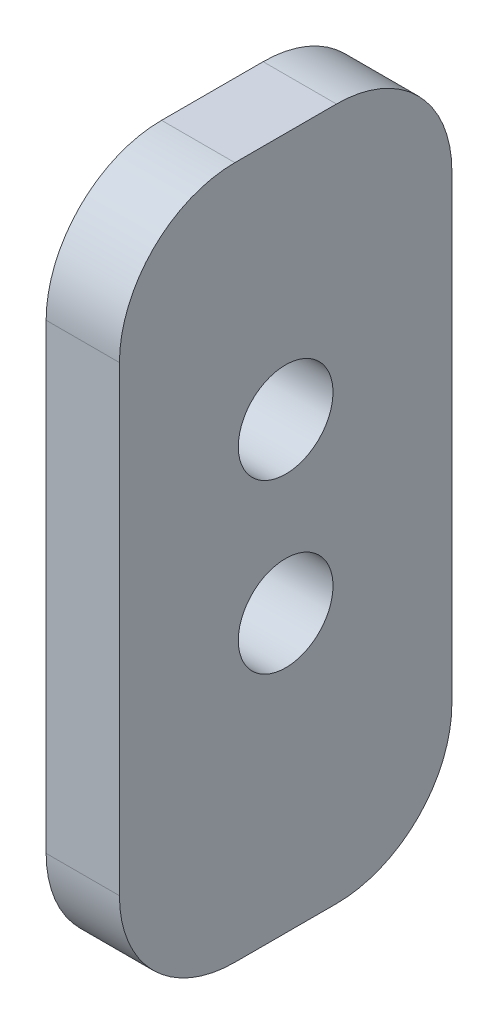
ISO-10303-21;
HEADER;
FILE_DESCRIPTION(('STEP AP214'),'2;1');
FILE_NAME('part.step','',(''),(''),'','','');
FILE_SCHEMA(('AUTOMOTIVE_DESIGN { 1 0 10303 214 1 1 1 1 }'));
ENDSEC;
DATA;
#1=APPLICATION_CONTEXT('core data for automotive mechanical design processes');
#2=APPLICATION_PROTOCOL_DEFINITION('international standard','automotive_design',2000,#1);
#3=PRODUCT_CONTEXT('',#1,'mechanical');
#4=PRODUCT('Part','Part','',(#3));
#5=PRODUCT_RELATED_PRODUCT_CATEGORY('part','',(#4));
#6=PRODUCT_DEFINITION_FORMATION('','',#4);
#7=PRODUCT_DEFINITION_CONTEXT('part definition',#1,'design');
#8=PRODUCT_DEFINITION('design','',#6,#7);
#9=PRODUCT_DEFINITION_SHAPE('','',#8);
#10=(LENGTH_UNIT() NAMED_UNIT(*) SI_UNIT(.MILLI.,.METRE.));
#11=(NAMED_UNIT(*) PLANE_ANGLE_UNIT() SI_UNIT($,.RADIAN.));
#12=(NAMED_UNIT(*) SI_UNIT($,.STERADIAN.) SOLID_ANGLE_UNIT());
#13=UNCERTAINTY_MEASURE_WITH_UNIT(LENGTH_MEASURE(1.E-05),#10,'distance_accuracy_value','');
#14=(GEOMETRIC_REPRESENTATION_CONTEXT(3) GLOBAL_UNCERTAINTY_ASSIGNED_CONTEXT((#13)) GLOBAL_UNIT_ASSIGNED_CONTEXT((#10,
#11,#12)) REPRESENTATION_CONTEXT('',''));
#15=CARTESIAN_POINT('',(0.,0.,0.));
#16=DIRECTION('',(0.,0.,1.));
#17=DIRECTION('',(1.,0.,0.));
#18=AXIS2_PLACEMENT_3D('',#15,#16,#17);
#19=CARTESIAN_POINT('',(6.35,0.,0.));
#20=DIRECTION('',(1.,0.,0.));
#21=DIRECTION('',(0.,0.,-1.));
#22=AXIS2_PLACEMENT_3D('',#19,#20,#21);
#23=PLANE('',#22);
#24=CARTESIAN_POINT('',(6.35,8.53000000000001,0.));
#25=DIRECTION('',(-1.,0.,0.));
#26=DIRECTION('',(0.,0.,1.));
#27=AXIS2_PLACEMENT_3D('',#24,#25,#26);
#28=CIRCLE('',#27,4.1021);
#29=CARTESIAN_POINT('',(6.35,8.53000000000001,4.1021));
#30=VERTEX_POINT('',#29);
#31=EDGE_CURVE('E178',#30,#30,#28,.T.);
#32=ORIENTED_EDGE('',*,*,#31,.T.);
#33=EDGE_LOOP('',(#32));
#34=FACE_BOUND('',#33,.T.);
#35=DIRECTION('',(0.,1.,0.));
#36=VECTOR('',#35,1.);
#37=CARTESIAN_POINT('',(6.35,0.,14.4));
#38=LINE('',#37,#36);
#39=CARTESIAN_POINT('',(6.35,-20.,14.4));
#40=VERTEX_POINT('',#39);
#41=CARTESIAN_POINT('',(6.35,20.,14.4));
#42=VERTEX_POINT('',#41);
#43=EDGE_CURVE('E162',#40,#42,#38,.T.);
#44=ORIENTED_EDGE('',*,*,#43,.F.);
#45=CARTESIAN_POINT('',(6.35,-20.,4.39999999999999));
#46=DIRECTION('',(1.,0.,0.));
#47=DIRECTION('',(0.,0.,-1.));
#48=AXIS2_PLACEMENT_3D('',#45,#46,#47);
#49=CIRCLE('',#48,10.);
#50=CARTESIAN_POINT('',(6.35,-30.,4.39999999999999));
#51=VERTEX_POINT('',#50);
#52=EDGE_CURVE('E151',#40,#51,#49,.T.);
#53=ORIENTED_EDGE('',*,*,#52,.T.);
#54=DIRECTION('',(0.,0.,1.));
#55=VECTOR('',#54,1.);
#56=CARTESIAN_POINT('',(6.35,-30.,0.));
#57=LINE('',#56,#55);
#58=CARTESIAN_POINT('',(6.35,-30.,-4.40000000000001));
#59=VERTEX_POINT('',#58);
#60=EDGE_CURVE('E164',#59,#51,#57,.T.);
#61=ORIENTED_EDGE('',*,*,#60,.F.);
#62=CARTESIAN_POINT('',(6.35,-20.,-4.40000000000001));
#63=DIRECTION('',(1.,0.,0.));
#64=DIRECTION('',(0.,0.,-1.));
#65=AXIS2_PLACEMENT_3D('',#62,#63,#64);
#66=CIRCLE('',#65,10.);
#67=CARTESIAN_POINT('',(6.35,-20.,-14.4));
#68=VERTEX_POINT('',#67);
#69=EDGE_CURVE('E128',#59,#68,#66,.T.);
#70=ORIENTED_EDGE('',*,*,#69,.T.);
#71=DIRECTION('',(0.,1.,0.));
#72=VECTOR('',#71,1.);
#73=CARTESIAN_POINT('',(6.35,0.,-14.4));
#74=LINE('',#73,#72);
#75=CARTESIAN_POINT('',(6.35,20.,-14.4));
#76=VERTEX_POINT('',#75);
#77=EDGE_CURVE('E133',#68,#76,#74,.T.);
#78=ORIENTED_EDGE('',*,*,#77,.T.);
#79=CARTESIAN_POINT('',(6.35,20.,-4.4));
#80=DIRECTION('',(1.,0.,0.));
#81=DIRECTION('',(0.,0.,-1.));
#82=AXIS2_PLACEMENT_3D('',#79,#80,#81);
#83=CIRCLE('',#82,10.);
#84=CARTESIAN_POINT('',(6.35,30.,-4.4));
#85=VERTEX_POINT('',#84);
#86=EDGE_CURVE('E57',#76,#85,#83,.T.);
#87=ORIENTED_EDGE('',*,*,#86,.T.);
#88=DIRECTION('',(0.,0.,1.));
#89=VECTOR('',#88,1.);
#90=CARTESIAN_POINT('',(6.35,30.,0.));
#91=LINE('',#90,#89);
#92=CARTESIAN_POINT('',(6.35,30.,4.4));
#93=VERTEX_POINT('',#92);
#94=EDGE_CURVE('E129',#85,#93,#91,.T.);
#95=ORIENTED_EDGE('',*,*,#94,.T.);
#96=CARTESIAN_POINT('',(6.35,20.,4.4));
#97=DIRECTION('',(1.,0.,0.));
#98=DIRECTION('',(0.,0.,-1.));
#99=AXIS2_PLACEMENT_3D('',#96,#97,#98);
#100=CIRCLE('',#99,10.);
#101=EDGE_CURVE('E148',#93,#42,#100,.T.);
#102=ORIENTED_EDGE('',*,*,#101,.T.);
#103=EDGE_LOOP('',(#44,#53,#61,#70,#78,#87,#95,#102));
#104=FACE_BOUND('',#103,.T.);
#105=CARTESIAN_POINT('',(6.35,-5.99999999999999,0.));
#106=DIRECTION('',(-1.,0.,0.));
#107=DIRECTION('',(0.,0.,1.));
#108=AXIS2_PLACEMENT_3D('',#105,#106,#107);
#109=CIRCLE('',#108,4.1021);
#110=CARTESIAN_POINT('',(6.35,-5.99999999999999,4.1021));
#111=VERTEX_POINT('',#110);
#112=EDGE_CURVE('E169',#111,#111,#109,.T.);
#113=ORIENTED_EDGE('',*,*,#112,.T.);
#114=EDGE_LOOP('',(#113));
#115=FACE_BOUND('',#114,.T.);
#116=ADVANCED_FACE('F37',(#34,#104,#115),#23,.T.);
#117=CARTESIAN_POINT('',(0.,0.,0.));
#118=DIRECTION('',(1.,0.,0.));
#119=DIRECTION('',(0.,0.,-1.));
#120=AXIS2_PLACEMENT_3D('',#117,#118,#119);
#121=PLANE('',#120);
#122=CARTESIAN_POINT('',(0.,8.53000000000001,0.));
#123=DIRECTION('',(-1.,0.,0.));
#124=DIRECTION('',(0.,0.,1.));
#125=AXIS2_PLACEMENT_3D('',#122,#123,#124);
#126=CIRCLE('',#125,4.1021);
#127=CARTESIAN_POINT('',(0.,8.53000000000001,4.1021));
#128=VERTEX_POINT('',#127);
#129=EDGE_CURVE('E181',#128,#128,#126,.T.);
#130=ORIENTED_EDGE('',*,*,#129,.F.);
#131=EDGE_LOOP('',(#130));
#132=FACE_BOUND('',#131,.T.);
#133=DIRECTION('',(0.,0.,1.));
#134=VECTOR('',#133,1.);
#135=CARTESIAN_POINT('',(0.,-30.,0.));
#136=LINE('',#135,#134);
#137=CARTESIAN_POINT('',(0.,-30.,-4.40000000000001));
#138=VERTEX_POINT('',#137);
#139=CARTESIAN_POINT('',(0.,-30.,4.39999999999999));
#140=VERTEX_POINT('',#139);
#141=EDGE_CURVE('E106',#138,#140,#136,.T.);
#142=ORIENTED_EDGE('',*,*,#141,.T.);
#143=CARTESIAN_POINT('',(0.,-20.,4.39999999999999));
#144=DIRECTION('',(1.,0.,0.));
#145=DIRECTION('',(0.,0.,-1.));
#146=AXIS2_PLACEMENT_3D('',#143,#144,#145);
#147=CIRCLE('',#146,10.);
#148=CARTESIAN_POINT('',(0.,-20.,14.4));
#149=VERTEX_POINT('',#148);
#150=EDGE_CURVE('E113',#140,#149,#147,.F.);
#151=ORIENTED_EDGE('',*,*,#150,.T.);
#152=DIRECTION('',(0.,1.,0.));
#153=VECTOR('',#152,1.);
#154=CARTESIAN_POINT('',(0.,0.,14.4));
#155=LINE('',#154,#153);
#156=CARTESIAN_POINT('',(0.,20.,14.4));
#157=VERTEX_POINT('',#156);
#158=EDGE_CURVE('E124',#149,#157,#155,.T.);
#159=ORIENTED_EDGE('',*,*,#158,.T.);
#160=CARTESIAN_POINT('',(0.,20.,4.4));
#161=DIRECTION('',(1.,0.,0.));
#162=DIRECTION('',(0.,0.,-1.));
#163=AXIS2_PLACEMENT_3D('',#160,#161,#162);
#164=CIRCLE('',#163,10.);
#165=CARTESIAN_POINT('',(0.,30.,4.4));
#166=VERTEX_POINT('',#165);
#167=EDGE_CURVE('E114',#157,#166,#164,.F.);
#168=ORIENTED_EDGE('',*,*,#167,.T.);
#169=DIRECTION('',(0.,0.,1.));
#170=VECTOR('',#169,1.);
#171=CARTESIAN_POINT('',(0.,30.,0.));
#172=LINE('',#171,#170);
#173=CARTESIAN_POINT('',(0.,30.,-4.4));
#174=VERTEX_POINT('',#173);
#175=EDGE_CURVE('E136',#174,#166,#172,.T.);
#176=ORIENTED_EDGE('',*,*,#175,.F.);
#177=CARTESIAN_POINT('',(0.,20.,-4.4));
#178=DIRECTION('',(1.,0.,0.));
#179=DIRECTION('',(0.,0.,-1.));
#180=AXIS2_PLACEMENT_3D('',#177,#178,#179);
#181=CIRCLE('',#180,10.);
#182=CARTESIAN_POINT('',(0.,20.,-14.4));
#183=VERTEX_POINT('',#182);
#184=EDGE_CURVE('E131',#174,#183,#181,.F.);
#185=ORIENTED_EDGE('',*,*,#184,.T.);
#186=DIRECTION('',(0.,1.,0.));
#187=VECTOR('',#186,1.);
#188=CARTESIAN_POINT('',(0.,0.,-14.4));
#189=LINE('',#188,#187);
#190=CARTESIAN_POINT('',(0.,-20.,-14.4));
#191=VERTEX_POINT('',#190);
#192=EDGE_CURVE('E108',#191,#183,#189,.T.);
#193=ORIENTED_EDGE('',*,*,#192,.F.);
#194=CARTESIAN_POINT('',(0.,-20.,-4.40000000000001));
#195=DIRECTION('',(1.,0.,0.));
#196=DIRECTION('',(0.,0.,-1.));
#197=AXIS2_PLACEMENT_3D('',#194,#195,#196);
#198=CIRCLE('',#197,10.);
#199=EDGE_CURVE('E102',#191,#138,#198,.F.);
#200=ORIENTED_EDGE('',*,*,#199,.T.);
#201=EDGE_LOOP('',(#142,#151,#159,#168,#176,#185,#193,#200));
#202=FACE_BOUND('',#201,.T.);
#203=CARTESIAN_POINT('',(0.,-5.99999999999999,0.));
#204=DIRECTION('',(-1.,0.,0.));
#205=DIRECTION('',(0.,0.,1.));
#206=AXIS2_PLACEMENT_3D('',#203,#204,#205);
#207=CIRCLE('',#206,4.1021);
#208=CARTESIAN_POINT('',(0.,-5.99999999999999,4.1021));
#209=VERTEX_POINT('',#208);
#210=EDGE_CURVE('E175',#209,#209,#207,.T.);
#211=ORIENTED_EDGE('',*,*,#210,.F.);
#212=EDGE_LOOP('',(#211));
#213=FACE_BOUND('',#212,.T.);
#214=ADVANCED_FACE('F104',(#132,#202,#213),#121,.F.);
#215=CARTESIAN_POINT('',(6.35,0.,14.4));
#216=DIRECTION('',(0.,0.,1.));
#217=DIRECTION('',(0.,-1.,0.));
#218=AXIS2_PLACEMENT_3D('',#215,#216,#217);
#219=PLANE('',#218);
#220=ORIENTED_EDGE('',*,*,#158,.F.);
#221=DIRECTION('',(-1.,0.,0.));
#222=VECTOR('',#221,1.);
#223=CARTESIAN_POINT('',(6.35,-20.,14.4));
#224=LINE('',#223,#222);
#225=EDGE_CURVE('E145',#149,#40,#224,.F.);
#226=ORIENTED_EDGE('',*,*,#225,.T.);
#227=ORIENTED_EDGE('',*,*,#43,.T.);
#228=DIRECTION('',(-1.,0.,0.));
#229=VECTOR('',#228,1.);
#230=CARTESIAN_POINT('',(0.,20.,14.4));
#231=LINE('',#230,#229);
#232=EDGE_CURVE('E142',#42,#157,#231,.T.);
#233=ORIENTED_EDGE('',*,*,#232,.T.);
#234=EDGE_LOOP('',(#220,#226,#227,#233));
#235=FACE_BOUND('',#234,.T.);
#236=ADVANCED_FACE('F188',(#235),#219,.T.);
#237=CARTESIAN_POINT('',(6.35,-30.,0.));
#238=DIRECTION('',(0.,-1.,0.));
#239=DIRECTION('',(0.,0.,-1.));
#240=AXIS2_PLACEMENT_3D('',#237,#238,#239);
#241=PLANE('',#240);
#242=ORIENTED_EDGE('',*,*,#60,.T.);
#243=DIRECTION('',(-1.,0.,0.));
#244=VECTOR('',#243,1.);
#245=CARTESIAN_POINT('',(6.35,-30.,4.39999999999999));
#246=LINE('',#245,#244);
#247=EDGE_CURVE('E123',#51,#140,#246,.T.);
#248=ORIENTED_EDGE('',*,*,#247,.T.);
#249=ORIENTED_EDGE('',*,*,#141,.F.);
#250=DIRECTION('',(-1.,0.,0.));
#251=VECTOR('',#250,1.);
#252=CARTESIAN_POINT('',(6.35,-30.,-4.40000000000001));
#253=LINE('',#252,#251);
#254=EDGE_CURVE('E120',#138,#59,#253,.F.);
#255=ORIENTED_EDGE('',*,*,#254,.T.);
#256=EDGE_LOOP('',(#242,#248,#249,#255));
#257=FACE_BOUND('',#256,.T.);
#258=ADVANCED_FACE('F119',(#257),#241,.T.);
#259=CARTESIAN_POINT('',(6.35,0.,-14.4));
#260=DIRECTION('',(0.,0.,1.));
#261=DIRECTION('',(0.,-1.,0.));
#262=AXIS2_PLACEMENT_3D('',#259,#260,#261);
#263=PLANE('',#262);
#264=ORIENTED_EDGE('',*,*,#77,.F.);
#265=DIRECTION('',(-1.,0.,0.));
#266=VECTOR('',#265,1.);
#267=CARTESIAN_POINT('',(0.,-20.,-14.4));
#268=LINE('',#267,#266);
#269=EDGE_CURVE('E155',#68,#191,#268,.T.);
#270=ORIENTED_EDGE('',*,*,#269,.T.);
#271=ORIENTED_EDGE('',*,*,#192,.T.);
#272=DIRECTION('',(-1.,0.,0.));
#273=VECTOR('',#272,1.);
#274=CARTESIAN_POINT('',(6.35,20.,-14.4));
#275=LINE('',#274,#273);
#276=EDGE_CURVE('E153',#183,#76,#275,.F.);
#277=ORIENTED_EDGE('',*,*,#276,.T.);
#278=EDGE_LOOP('',(#264,#270,#271,#277));
#279=FACE_BOUND('',#278,.T.);
#280=ADVANCED_FACE('F203',(#279),#263,.F.);
#281=CARTESIAN_POINT('',(6.35,30.,0.));
#282=DIRECTION('',(0.,-1.,0.));
#283=DIRECTION('',(0.,0.,-1.));
#284=AXIS2_PLACEMENT_3D('',#281,#282,#283);
#285=PLANE('',#284);
#286=ORIENTED_EDGE('',*,*,#175,.T.);
#287=DIRECTION('',(-1.,0.,0.));
#288=VECTOR('',#287,1.);
#289=CARTESIAN_POINT('',(6.35,30.,4.4));
#290=LINE('',#289,#288);
#291=EDGE_CURVE('E11',#166,#93,#290,.F.);
#292=ORIENTED_EDGE('',*,*,#291,.T.);
#293=ORIENTED_EDGE('',*,*,#94,.F.);
#294=DIRECTION('',(-1.,0.,0.));
#295=VECTOR('',#294,1.);
#296=CARTESIAN_POINT('',(6.35,30.,-4.4));
#297=LINE('',#296,#295);
#298=EDGE_CURVE('E45',#85,#174,#297,.T.);
#299=ORIENTED_EDGE('',*,*,#298,.T.);
#300=EDGE_LOOP('',(#286,#292,#293,#299));
#301=FACE_BOUND('',#300,.T.);
#302=ADVANCED_FACE('F159',(#301),#285,.F.);
#303=CARTESIAN_POINT('',(0.,-5.99999999999999,0.));
#304=DIRECTION('',(-1.,0.,0.));
#305=DIRECTION('',(0.,0.,1.));
#306=AXIS2_PLACEMENT_3D('',#303,#304,#305);
#307=CYLINDRICAL_SURFACE('',#306,4.1021);
#308=ORIENTED_EDGE('',*,*,#112,.F.);
#309=EDGE_LOOP('',(#308));
#310=FACE_BOUND('',#309,.T.);
#311=ORIENTED_EDGE('',*,*,#210,.T.);
#312=EDGE_LOOP('',(#311));
#313=FACE_BOUND('',#312,.T.);
#314=ADVANCED_FACE('F202',(#310,#313),#307,.F.);
#315=CARTESIAN_POINT('',(0.,8.53000000000001,0.));
#316=DIRECTION('',(-1.,0.,0.));
#317=DIRECTION('',(0.,0.,1.));
#318=AXIS2_PLACEMENT_3D('',#315,#316,#317);
#319=CYLINDRICAL_SURFACE('',#318,4.1021);
#320=ORIENTED_EDGE('',*,*,#31,.F.);
#321=EDGE_LOOP('',(#320));
#322=FACE_BOUND('',#321,.T.);
#323=ORIENTED_EDGE('',*,*,#129,.T.);
#324=EDGE_LOOP('',(#323));
#325=FACE_BOUND('',#324,.T.);
#326=ADVANCED_FACE('F185',(#322,#325),#319,.F.);
#327=CARTESIAN_POINT('',(6.35,-20.,4.39999999999999));
#328=DIRECTION('',(-1.,0.,0.));
#329=DIRECTION('',(0.,0.,1.));
#330=AXIS2_PLACEMENT_3D('',#327,#328,#329);
#331=CYLINDRICAL_SURFACE('',#330,10.);
#332=ORIENTED_EDGE('',*,*,#52,.F.);
#333=ORIENTED_EDGE('',*,*,#225,.F.);
#334=ORIENTED_EDGE('',*,*,#150,.F.);
#335=ORIENTED_EDGE('',*,*,#247,.F.);
#336=EDGE_LOOP('',(#332,#333,#334,#335));
#337=FACE_BOUND('',#336,.T.);
#338=ADVANCED_FACE('F208',(#337),#331,.T.);
#339=CARTESIAN_POINT('',(6.35,-20.,-4.40000000000001));
#340=DIRECTION('',(1.,0.,0.));
#341=DIRECTION('',(0.,0.,-1.));
#342=AXIS2_PLACEMENT_3D('',#339,#340,#341);
#343=CYLINDRICAL_SURFACE('',#342,10.);
#344=ORIENTED_EDGE('',*,*,#69,.F.);
#345=ORIENTED_EDGE('',*,*,#254,.F.);
#346=ORIENTED_EDGE('',*,*,#199,.F.);
#347=ORIENTED_EDGE('',*,*,#269,.F.);
#348=EDGE_LOOP('',(#344,#345,#346,#347));
#349=FACE_BOUND('',#348,.T.);
#350=ADVANCED_FACE('F127',(#349),#343,.T.);
#351=CARTESIAN_POINT('',(6.35,20.,4.4));
#352=DIRECTION('',(1.,0.,0.));
#353=DIRECTION('',(0.,0.,-1.));
#354=AXIS2_PLACEMENT_3D('',#351,#352,#353);
#355=CYLINDRICAL_SURFACE('',#354,10.);
#356=ORIENTED_EDGE('',*,*,#101,.F.);
#357=ORIENTED_EDGE('',*,*,#291,.F.);
#358=ORIENTED_EDGE('',*,*,#167,.F.);
#359=ORIENTED_EDGE('',*,*,#232,.F.);
#360=EDGE_LOOP('',(#356,#357,#358,#359));
#361=FACE_BOUND('',#360,.T.);
#362=ADVANCED_FACE('F213',(#361),#355,.T.);
#363=CARTESIAN_POINT('',(6.35,20.,-4.4));
#364=DIRECTION('',(-1.,0.,0.));
#365=DIRECTION('',(0.,0.,1.));
#366=AXIS2_PLACEMENT_3D('',#363,#364,#365);
#367=CYLINDRICAL_SURFACE('',#366,10.);
#368=ORIENTED_EDGE('',*,*,#86,.F.);
#369=ORIENTED_EDGE('',*,*,#276,.F.);
#370=ORIENTED_EDGE('',*,*,#184,.F.);
#371=ORIENTED_EDGE('',*,*,#298,.F.);
#372=EDGE_LOOP('',(#368,#369,#370,#371));
#373=FACE_BOUND('',#372,.T.);
#374=ADVANCED_FACE('F39',(#373),#367,.T.);
#375=CLOSED_SHELL('',(#116,#214,#236,#258,#280,#302,#314,#326,#338,#350,#362,#374));
#376=MANIFOLD_SOLID_BREP('B2',#375);
#377=ADVANCED_BREP_SHAPE_REPRESENTATION('',(#18,#376),#14);
#378=SHAPE_DEFINITION_REPRESENTATION(#9,#377);
ENDSEC;
END-ISO-10303-21;
